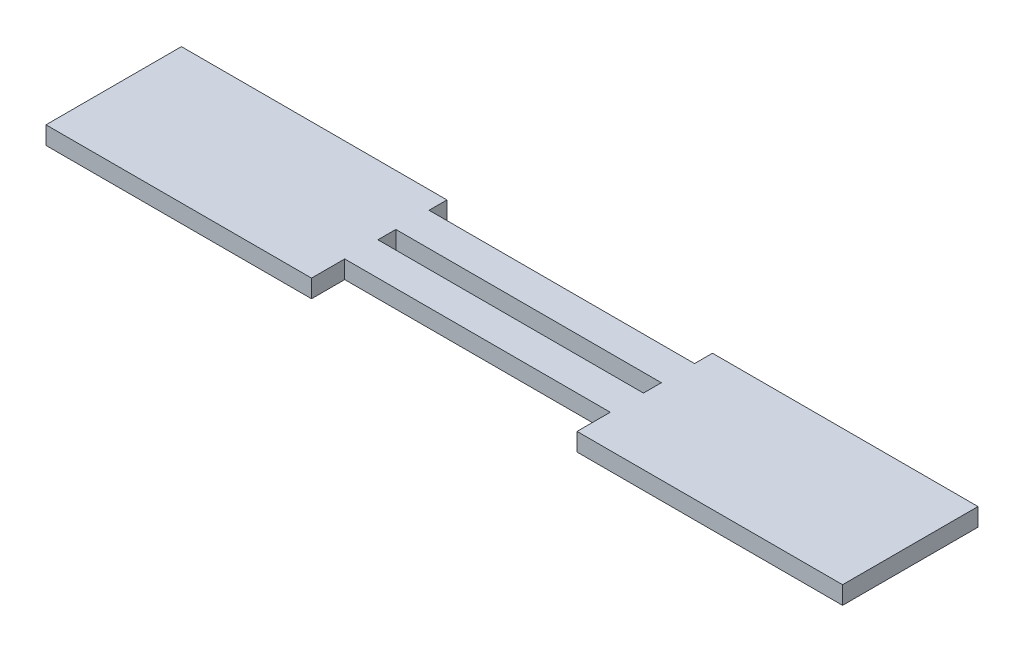
ISO-10303-21;
HEADER;
FILE_DESCRIPTION(('STEP AP214'),'2;1');
FILE_NAME('part.step','',(''),(''),'','','');
FILE_SCHEMA(('AUTOMOTIVE_DESIGN { 1 0 10303 214 1 1 1 1 }'));
ENDSEC;
DATA;
#1=APPLICATION_CONTEXT('core data for automotive mechanical design processes');
#2=APPLICATION_PROTOCOL_DEFINITION('international standard','automotive_design',2000,#1);
#3=PRODUCT_CONTEXT('',#1,'mechanical');
#4=PRODUCT('Part','Part','',(#3));
#5=PRODUCT_RELATED_PRODUCT_CATEGORY('part','',(#4));
#6=PRODUCT_DEFINITION_FORMATION('','',#4);
#7=PRODUCT_DEFINITION_CONTEXT('part definition',#1,'design');
#8=PRODUCT_DEFINITION('design','',#6,#7);
#9=PRODUCT_DEFINITION_SHAPE('','',#8);
#10=(LENGTH_UNIT() NAMED_UNIT(*) SI_UNIT(.MILLI.,.METRE.));
#11=(NAMED_UNIT(*) PLANE_ANGLE_UNIT() SI_UNIT($,.RADIAN.));
#12=(NAMED_UNIT(*) SI_UNIT($,.STERADIAN.) SOLID_ANGLE_UNIT());
#13=UNCERTAINTY_MEASURE_WITH_UNIT(LENGTH_MEASURE(1.E-05),#10,'distance_accuracy_value','');
#14=(GEOMETRIC_REPRESENTATION_CONTEXT(3) GLOBAL_UNCERTAINTY_ASSIGNED_CONTEXT((#13)) GLOBAL_UNIT_ASSIGNED_CONTEXT((#10,
#11,#12)) REPRESENTATION_CONTEXT('',''));
#15=CARTESIAN_POINT('',(0.,0.,0.));
#16=DIRECTION('',(0.,0.,1.));
#17=DIRECTION('',(1.,0.,0.));
#18=AXIS2_PLACEMENT_3D('',#15,#16,#17);
#19=CARTESIAN_POINT('',(0.,2.7,0.));
#20=DIRECTION('',(0.,-1.,0.));
#21=DIRECTION('',(0.,0.,-1.));
#22=AXIS2_PLACEMENT_3D('',#19,#20,#21);
#23=PLANE('',#22);
#24=DIRECTION('',(1.,0.,0.));
#25=VECTOR('',#24,1.);
#26=CARTESIAN_POINT('',(20.,2.7,15.9090628345809));
#27=LINE('',#26,#25);
#28=CARTESIAN_POINT('',(20.,2.7,15.9090628345809));
#29=VERTEX_POINT('',#28);
#30=CARTESIAN_POINT('',(60.,2.7,15.9090628345809));
#31=VERTEX_POINT('',#30);
#32=EDGE_CURVE('E182',#29,#31,#27,.T.);
#33=ORIENTED_EDGE('',*,*,#32,.T.);
#34=DIRECTION('',(0.,0.,-1.));
#35=VECTOR('',#34,1.);
#36=CARTESIAN_POINT('',(60.,2.7,5.90906283458089));
#37=LINE('',#36,#35);
#38=CARTESIAN_POINT('',(60.,2.7,-4.49093716541911));
#39=VERTEX_POINT('',#38);
#40=EDGE_CURVE('E185',#31,#39,#37,.T.);
#41=ORIENTED_EDGE('',*,*,#40,.T.);
#42=DIRECTION('',(-1.,0.,0.));
#43=VECTOR('',#42,1.);
#44=CARTESIAN_POINT('',(20.,2.7,-4.49093716541911));
#45=LINE('',#44,#43);
#46=CARTESIAN_POINT('',(20.,2.7,-4.49093716541911));
#47=VERTEX_POINT('',#46);
#48=EDGE_CURVE('E188',#39,#47,#45,.T.);
#49=ORIENTED_EDGE('',*,*,#48,.T.);
#50=DIRECTION('',(0.,0.,1.));
#51=VECTOR('',#50,1.);
#52=CARTESIAN_POINT('',(20.,2.7,-4.49093716541911));
#53=LINE('',#52,#51);
#54=CARTESIAN_POINT('',(20.,2.7,-1.79093716541911));
#55=VERTEX_POINT('',#54);
#56=EDGE_CURVE('E190',#47,#55,#53,.T.);
#57=ORIENTED_EDGE('',*,*,#56,.T.);
#58=DIRECTION('',(-1.,0.,0.));
#59=VECTOR('',#58,1.);
#60=CARTESIAN_POINT('',(-20.,2.7,-1.79093716541911));
#61=LINE('',#60,#59);
#62=CARTESIAN_POINT('',(-20.,2.7,-1.79093716541911));
#63=VERTEX_POINT('',#62);
#64=EDGE_CURVE('E192',#55,#63,#61,.T.);
#65=ORIENTED_EDGE('',*,*,#64,.T.);
#66=DIRECTION('',(0.,0.,-1.));
#67=VECTOR('',#66,1.);
#68=CARTESIAN_POINT('',(-20.,2.7,-4.49093716541911));
#69=LINE('',#68,#67);
#70=CARTESIAN_POINT('',(-20.,2.7,-4.49093716541911));
#71=VERTEX_POINT('',#70);
#72=EDGE_CURVE('E194',#63,#71,#69,.T.);
#73=ORIENTED_EDGE('',*,*,#72,.T.);
#74=DIRECTION('',(-1.,0.,0.));
#75=VECTOR('',#74,1.);
#76=CARTESIAN_POINT('',(-60.,2.7,-4.49093716541911));
#77=LINE('',#76,#75);
#78=CARTESIAN_POINT('',(-60.,2.7,-4.49093716541911));
#79=VERTEX_POINT('',#78);
#80=EDGE_CURVE('E196',#71,#79,#77,.T.);
#81=ORIENTED_EDGE('',*,*,#80,.T.);
#82=DIRECTION('',(0.,0.,1.));
#83=VECTOR('',#82,1.);
#84=CARTESIAN_POINT('',(-60.,2.7,-4.49093716541911));
#85=LINE('',#84,#83);
#86=CARTESIAN_POINT('',(-60.,2.7,15.9090628345809));
#87=VERTEX_POINT('',#86);
#88=EDGE_CURVE('E198',#79,#87,#85,.T.);
#89=ORIENTED_EDGE('',*,*,#88,.T.);
#90=DIRECTION('',(1.,0.,0.));
#91=VECTOR('',#90,1.);
#92=CARTESIAN_POINT('',(-60.,2.7,15.9090628345809));
#93=LINE('',#92,#91);
#94=CARTESIAN_POINT('',(-20.,2.7,15.9090628345809));
#95=VERTEX_POINT('',#94);
#96=EDGE_CURVE('E200',#87,#95,#93,.T.);
#97=ORIENTED_EDGE('',*,*,#96,.T.);
#98=DIRECTION('',(0.,0.,-1.));
#99=VECTOR('',#98,1.);
#100=CARTESIAN_POINT('',(-20.,2.7,10.9090628345809));
#101=LINE('',#100,#99);
#102=CARTESIAN_POINT('',(-20.,2.7,10.9090628345809));
#103=VERTEX_POINT('',#102);
#104=EDGE_CURVE('E202',#95,#103,#101,.T.);
#105=ORIENTED_EDGE('',*,*,#104,.T.);
#106=DIRECTION('',(1.,0.,0.));
#107=VECTOR('',#106,1.);
#108=CARTESIAN_POINT('',(-20.,2.7,10.9090628345809));
#109=LINE('',#108,#107);
#110=CARTESIAN_POINT('',(20.,2.7,10.9090628345809));
#111=VERTEX_POINT('',#110);
#112=EDGE_CURVE('E204',#103,#111,#109,.T.);
#113=ORIENTED_EDGE('',*,*,#112,.T.);
#114=DIRECTION('',(0.,0.,1.));
#115=VECTOR('',#114,1.);
#116=CARTESIAN_POINT('',(20.,2.7,10.9090628345809));
#117=LINE('',#116,#115);
#118=EDGE_CURVE('E206',#111,#29,#117,.T.);
#119=ORIENTED_EDGE('',*,*,#118,.T.);
#120=EDGE_LOOP('',(#33,#41,#49,#57,#65,#73,#81,#89,#97,#105,#113,#119));
#121=FACE_BOUND('',#120,.T.);
#122=DIRECTION('',(0.,0.,1.));
#123=VECTOR('',#122,1.);
#124=CARTESIAN_POINT('',(-20.,2.7,3.20906283458089));
#125=LINE('',#124,#123);
#126=CARTESIAN_POINT('',(-20.,2.7,3.20906283458089));
#127=VERTEX_POINT('',#126);
#128=CARTESIAN_POINT('',(-20.,2.7,5.90906283458089));
#129=VERTEX_POINT('',#128);
#130=EDGE_CURVE('E146',#127,#129,#125,.T.);
#131=ORIENTED_EDGE('',*,*,#130,.F.);
#132=DIRECTION('',(-1.,0.,0.));
#133=VECTOR('',#132,1.);
#134=CARTESIAN_POINT('',(-20.,2.7,3.20906283458089));
#135=LINE('',#134,#133);
#136=CARTESIAN_POINT('',(20.,2.7,3.20906283458089));
#137=VERTEX_POINT('',#136);
#138=EDGE_CURVE('E168',#137,#127,#135,.T.);
#139=ORIENTED_EDGE('',*,*,#138,.F.);
#140=DIRECTION('',(0.,0.,-1.));
#141=VECTOR('',#140,1.);
#142=CARTESIAN_POINT('',(20.,2.7,3.20906283458089));
#143=LINE('',#142,#141);
#144=CARTESIAN_POINT('',(20.,2.7,5.90906283458089));
#145=VERTEX_POINT('',#144);
#146=EDGE_CURVE('E166',#145,#137,#143,.T.);
#147=ORIENTED_EDGE('',*,*,#146,.F.);
#148=DIRECTION('',(1.,0.,0.));
#149=VECTOR('',#148,1.);
#150=CARTESIAN_POINT('',(20.,2.7,5.90906283458089));
#151=LINE('',#150,#149);
#152=EDGE_CURVE('E154',#129,#145,#151,.T.);
#153=ORIENTED_EDGE('',*,*,#152,.F.);
#154=EDGE_LOOP('',(#131,#139,#147,#153));
#155=FACE_BOUND('',#154,.T.);
#156=ADVANCED_FACE('F33',(#121,#155),#23,.F.);
#157=CARTESIAN_POINT('',(0.,0.,0.));
#158=DIRECTION('',(0.,-1.,0.));
#159=DIRECTION('',(0.,0.,-1.));
#160=AXIS2_PLACEMENT_3D('',#157,#158,#159);
#161=PLANE('',#160);
#162=DIRECTION('',(1.,0.,0.));
#163=VECTOR('',#162,1.);
#164=CARTESIAN_POINT('',(20.,0.,15.9090628345809));
#165=LINE('',#164,#163);
#166=CARTESIAN_POINT('',(20.,0.,15.9090628345809));
#167=VERTEX_POINT('',#166);
#168=CARTESIAN_POINT('',(60.,0.,15.9090628345809));
#169=VERTEX_POINT('',#168);
#170=EDGE_CURVE('E162',#167,#169,#165,.T.);
#171=ORIENTED_EDGE('',*,*,#170,.F.);
#172=DIRECTION('',(0.,0.,1.));
#173=VECTOR('',#172,1.);
#174=CARTESIAN_POINT('',(20.,0.,10.9090628345809));
#175=LINE('',#174,#173);
#176=CARTESIAN_POINT('',(20.,0.,10.9090628345809));
#177=VERTEX_POINT('',#176);
#178=EDGE_CURVE('E186',#177,#167,#175,.T.);
#179=ORIENTED_EDGE('',*,*,#178,.F.);
#180=DIRECTION('',(1.,0.,0.));
#181=VECTOR('',#180,1.);
#182=CARTESIAN_POINT('',(-20.,0.,10.9090628345809));
#183=LINE('',#182,#181);
#184=CARTESIAN_POINT('',(-20.,0.,10.9090628345809));
#185=VERTEX_POINT('',#184);
#186=EDGE_CURVE('E230',#185,#177,#183,.T.);
#187=ORIENTED_EDGE('',*,*,#186,.F.);
#188=DIRECTION('',(0.,0.,-1.));
#189=VECTOR('',#188,1.);
#190=CARTESIAN_POINT('',(-20.,0.,10.9090628345809));
#191=LINE('',#190,#189);
#192=CARTESIAN_POINT('',(-20.,0.,15.9090628345809));
#193=VERTEX_POINT('',#192);
#194=EDGE_CURVE('E228',#193,#185,#191,.T.);
#195=ORIENTED_EDGE('',*,*,#194,.F.);
#196=DIRECTION('',(1.,0.,0.));
#197=VECTOR('',#196,1.);
#198=CARTESIAN_POINT('',(-60.,0.,15.9090628345809));
#199=LINE('',#198,#197);
#200=CARTESIAN_POINT('',(-60.,0.,15.9090628345809));
#201=VERTEX_POINT('',#200);
#202=EDGE_CURVE('E226',#201,#193,#199,.T.);
#203=ORIENTED_EDGE('',*,*,#202,.F.);
#204=DIRECTION('',(0.,0.,1.));
#205=VECTOR('',#204,1.);
#206=CARTESIAN_POINT('',(-60.,0.,5.90906283458089));
#207=LINE('',#206,#205);
#208=CARTESIAN_POINT('',(-60.,0.,-4.49093716541911));
#209=VERTEX_POINT('',#208);
#210=EDGE_CURVE('E224',#209,#201,#207,.T.);
#211=ORIENTED_EDGE('',*,*,#210,.F.);
#212=DIRECTION('',(-1.,0.,0.));
#213=VECTOR('',#212,1.);
#214=CARTESIAN_POINT('',(-60.,0.,-4.49093716541911));
#215=LINE('',#214,#213);
#216=CARTESIAN_POINT('',(-20.,0.,-4.49093716541911));
#217=VERTEX_POINT('',#216);
#218=EDGE_CURVE('E221',#217,#209,#215,.T.);
#219=ORIENTED_EDGE('',*,*,#218,.F.);
#220=DIRECTION('',(0.,0.,-1.));
#221=VECTOR('',#220,1.);
#222=CARTESIAN_POINT('',(-20.,0.,-4.49093716541911));
#223=LINE('',#222,#221);
#224=CARTESIAN_POINT('',(-20.,0.,-1.79093716541911));
#225=VERTEX_POINT('',#224);
#226=EDGE_CURVE('E219',#225,#217,#223,.T.);
#227=ORIENTED_EDGE('',*,*,#226,.F.);
#228=DIRECTION('',(-1.,0.,0.));
#229=VECTOR('',#228,1.);
#230=CARTESIAN_POINT('',(-20.,0.,-1.79093716541911));
#231=LINE('',#230,#229);
#232=CARTESIAN_POINT('',(20.,0.,-1.79093716541911));
#233=VERTEX_POINT('',#232);
#234=EDGE_CURVE('E217',#233,#225,#231,.T.);
#235=ORIENTED_EDGE('',*,*,#234,.F.);
#236=DIRECTION('',(0.,0.,1.));
#237=VECTOR('',#236,1.);
#238=CARTESIAN_POINT('',(20.,0.,-4.49093716541911));
#239=LINE('',#238,#237);
#240=CARTESIAN_POINT('',(20.,0.,-4.49093716541911));
#241=VERTEX_POINT('',#240);
#242=EDGE_CURVE('E215',#241,#233,#239,.T.);
#243=ORIENTED_EDGE('',*,*,#242,.F.);
#244=DIRECTION('',(-1.,0.,0.));
#245=VECTOR('',#244,1.);
#246=CARTESIAN_POINT('',(20.,0.,-4.49093716541911));
#247=LINE('',#246,#245);
#248=CARTESIAN_POINT('',(60.,0.,-4.49093716541911));
#249=VERTEX_POINT('',#248);
#250=EDGE_CURVE('E213',#249,#241,#247,.T.);
#251=ORIENTED_EDGE('',*,*,#250,.F.);
#252=DIRECTION('',(0.,0.,-1.));
#253=VECTOR('',#252,1.);
#254=CARTESIAN_POINT('',(60.,0.,-4.49093716541911));
#255=LINE('',#254,#253);
#256=EDGE_CURVE('E211',#169,#249,#255,.T.);
#257=ORIENTED_EDGE('',*,*,#256,.F.);
#258=EDGE_LOOP('',(#171,#179,#187,#195,#203,#211,#219,#227,#235,#243,#251,#257));
#259=FACE_BOUND('',#258,.T.);
#260=DIRECTION('',(-1.,0.,0.));
#261=VECTOR('',#260,1.);
#262=CARTESIAN_POINT('',(-20.,0.,3.20906283458089));
#263=LINE('',#262,#261);
#264=CARTESIAN_POINT('',(20.,0.,3.20906283458089));
#265=VERTEX_POINT('',#264);
#266=CARTESIAN_POINT('',(-20.,0.,3.20906283458089));
#267=VERTEX_POINT('',#266);
#268=EDGE_CURVE('E155',#265,#267,#263,.T.);
#269=ORIENTED_EDGE('',*,*,#268,.T.);
#270=DIRECTION('',(0.,0.,1.));
#271=VECTOR('',#270,1.);
#272=CARTESIAN_POINT('',(-20.,0.,3.20906283458089));
#273=LINE('',#272,#271);
#274=CARTESIAN_POINT('',(-20.,0.,5.90906283458089));
#275=VERTEX_POINT('',#274);
#276=EDGE_CURVE('E56',#267,#275,#273,.T.);
#277=ORIENTED_EDGE('',*,*,#276,.T.);
#278=DIRECTION('',(1.,0.,0.));
#279=VECTOR('',#278,1.);
#280=CARTESIAN_POINT('',(20.,0.,5.90906283458089));
#281=LINE('',#280,#279);
#282=CARTESIAN_POINT('',(20.,0.,5.90906283458089));
#283=VERTEX_POINT('',#282);
#284=EDGE_CURVE('E161',#275,#283,#281,.T.);
#285=ORIENTED_EDGE('',*,*,#284,.T.);
#286=DIRECTION('',(0.,0.,-1.));
#287=VECTOR('',#286,1.);
#288=CARTESIAN_POINT('',(20.,0.,3.20906283458089));
#289=LINE('',#288,#287);
#290=EDGE_CURVE('E174',#283,#265,#289,.T.);
#291=ORIENTED_EDGE('',*,*,#290,.T.);
#292=EDGE_LOOP('',(#269,#277,#285,#291));
#293=FACE_BOUND('',#292,.T.);
#294=ADVANCED_FACE('F272',(#259,#293),#161,.T.);
#295=CARTESIAN_POINT('',(20.,2.7,15.9090628345809));
#296=DIRECTION('',(0.,0.,-1.));
#297=DIRECTION('',(-1.,0.,0.));
#298=AXIS2_PLACEMENT_3D('',#295,#296,#297);
#299=PLANE('',#298);
#300=ORIENTED_EDGE('',*,*,#170,.T.);
#301=DIRECTION('',(0.,-1.,0.));
#302=VECTOR('',#301,1.);
#303=CARTESIAN_POINT('',(60.,2.7,15.9090628345809));
#304=LINE('',#303,#302);
#305=EDGE_CURVE('E11',#31,#169,#304,.T.);
#306=ORIENTED_EDGE('',*,*,#305,.F.);
#307=ORIENTED_EDGE('',*,*,#32,.F.);
#308=DIRECTION('',(0.,-1.,0.));
#309=VECTOR('',#308,1.);
#310=CARTESIAN_POINT('',(20.,2.7,15.9090628345809));
#311=LINE('',#310,#309);
#312=EDGE_CURVE('E208',#29,#167,#311,.T.);
#313=ORIENTED_EDGE('',*,*,#312,.T.);
#314=EDGE_LOOP('',(#300,#306,#307,#313));
#315=FACE_BOUND('',#314,.T.);
#316=ADVANCED_FACE('F35',(#315),#299,.F.);
#317=CARTESIAN_POINT('',(60.,2.7,-4.49093716541911));
#318=DIRECTION('',(-1.,0.,0.));
#319=DIRECTION('',(0.,0.,1.));
#320=AXIS2_PLACEMENT_3D('',#317,#318,#319);
#321=PLANE('',#320);
#322=ORIENTED_EDGE('',*,*,#256,.T.);
#323=DIRECTION('',(0.,-1.,0.));
#324=VECTOR('',#323,1.);
#325=CARTESIAN_POINT('',(60.,2.7,-4.49093716541911));
#326=LINE('',#325,#324);
#327=EDGE_CURVE('E41',#39,#249,#326,.T.);
#328=ORIENTED_EDGE('',*,*,#327,.F.);
#329=ORIENTED_EDGE('',*,*,#40,.F.);
#330=ORIENTED_EDGE('',*,*,#305,.T.);
#331=EDGE_LOOP('',(#322,#328,#329,#330));
#332=FACE_BOUND('',#331,.T.);
#333=ADVANCED_FACE('F289',(#332),#321,.F.);
#334=CARTESIAN_POINT('',(20.,2.7,-4.49093716541911));
#335=DIRECTION('',(0.,0.,1.));
#336=DIRECTION('',(1.,0.,0.));
#337=AXIS2_PLACEMENT_3D('',#334,#335,#336);
#338=PLANE('',#337);
#339=ORIENTED_EDGE('',*,*,#250,.T.);
#340=DIRECTION('',(0.,-1.,0.));
#341=VECTOR('',#340,1.);
#342=CARTESIAN_POINT('',(20.,2.7,-4.49093716541911));
#343=LINE('',#342,#341);
#344=EDGE_CURVE('E259',#47,#241,#343,.T.);
#345=ORIENTED_EDGE('',*,*,#344,.F.);
#346=ORIENTED_EDGE('',*,*,#48,.F.);
#347=ORIENTED_EDGE('',*,*,#327,.T.);
#348=EDGE_LOOP('',(#339,#345,#346,#347));
#349=FACE_BOUND('',#348,.T.);
#350=ADVANCED_FACE('F266',(#349),#338,.F.);
#351=CARTESIAN_POINT('',(20.,2.7,-4.49093716541911));
#352=DIRECTION('',(1.,0.,0.));
#353=DIRECTION('',(0.,0.,-1.));
#354=AXIS2_PLACEMENT_3D('',#351,#352,#353);
#355=PLANE('',#354);
#356=ORIENTED_EDGE('',*,*,#242,.T.);
#357=DIRECTION('',(0.,-1.,0.));
#358=VECTOR('',#357,1.);
#359=CARTESIAN_POINT('',(20.,2.7,-1.79093716541911));
#360=LINE('',#359,#358);
#361=EDGE_CURVE('E256',#55,#233,#360,.T.);
#362=ORIENTED_EDGE('',*,*,#361,.F.);
#363=ORIENTED_EDGE('',*,*,#56,.F.);
#364=ORIENTED_EDGE('',*,*,#344,.T.);
#365=EDGE_LOOP('',(#356,#362,#363,#364));
#366=FACE_BOUND('',#365,.T.);
#367=ADVANCED_FACE('F278',(#366),#355,.F.);
#368=CARTESIAN_POINT('',(-20.,2.7,-1.79093716541911));
#369=DIRECTION('',(0.,0.,1.));
#370=DIRECTION('',(1.,0.,0.));
#371=AXIS2_PLACEMENT_3D('',#368,#369,#370);
#372=PLANE('',#371);
#373=ORIENTED_EDGE('',*,*,#234,.T.);
#374=DIRECTION('',(0.,-1.,0.));
#375=VECTOR('',#374,1.);
#376=CARTESIAN_POINT('',(-20.,2.7,-1.79093716541911));
#377=LINE('',#376,#375);
#378=EDGE_CURVE('E253',#63,#225,#377,.T.);
#379=ORIENTED_EDGE('',*,*,#378,.F.);
#380=ORIENTED_EDGE('',*,*,#64,.F.);
#381=ORIENTED_EDGE('',*,*,#361,.T.);
#382=EDGE_LOOP('',(#373,#379,#380,#381));
#383=FACE_BOUND('',#382,.T.);
#384=ADVANCED_FACE('F282',(#383),#372,.F.);
#385=CARTESIAN_POINT('',(-20.,2.7,-4.49093716541911));
#386=DIRECTION('',(-1.,0.,0.));
#387=DIRECTION('',(0.,0.,1.));
#388=AXIS2_PLACEMENT_3D('',#385,#386,#387);
#389=PLANE('',#388);
#390=ORIENTED_EDGE('',*,*,#226,.T.);
#391=DIRECTION('',(0.,-1.,0.));
#392=VECTOR('',#391,1.);
#393=CARTESIAN_POINT('',(-20.,2.7,-4.49093716541911));
#394=LINE('',#393,#392);
#395=EDGE_CURVE('E250',#71,#217,#394,.T.);
#396=ORIENTED_EDGE('',*,*,#395,.F.);
#397=ORIENTED_EDGE('',*,*,#72,.F.);
#398=ORIENTED_EDGE('',*,*,#378,.T.);
#399=EDGE_LOOP('',(#390,#396,#397,#398));
#400=FACE_BOUND('',#399,.T.);
#401=ADVANCED_FACE('F321',(#400),#389,.F.);
#402=CARTESIAN_POINT('',(-60.,2.7,-4.49093716541911));
#403=DIRECTION('',(0.,0.,1.));
#404=DIRECTION('',(1.,0.,0.));
#405=AXIS2_PLACEMENT_3D('',#402,#403,#404);
#406=PLANE('',#405);
#407=ORIENTED_EDGE('',*,*,#218,.T.);
#408=DIRECTION('',(0.,-1.,0.));
#409=VECTOR('',#408,1.);
#410=CARTESIAN_POINT('',(-60.,2.7,-4.49093716541911));
#411=LINE('',#410,#409);
#412=EDGE_CURVE('E247',#79,#209,#411,.T.);
#413=ORIENTED_EDGE('',*,*,#412,.F.);
#414=ORIENTED_EDGE('',*,*,#80,.F.);
#415=ORIENTED_EDGE('',*,*,#395,.T.);
#416=EDGE_LOOP('',(#407,#413,#414,#415));
#417=FACE_BOUND('',#416,.T.);
#418=ADVANCED_FACE('F319',(#417),#406,.F.);
#419=CARTESIAN_POINT('',(-60.,2.7,5.90906283458089));
#420=DIRECTION('',(1.,0.,0.));
#421=DIRECTION('',(0.,0.,-1.));
#422=AXIS2_PLACEMENT_3D('',#419,#420,#421);
#423=PLANE('',#422);
#424=ORIENTED_EDGE('',*,*,#210,.T.);
#425=DIRECTION('',(0.,-1.,0.));
#426=VECTOR('',#425,1.);
#427=CARTESIAN_POINT('',(-60.,2.7,15.9090628345809));
#428=LINE('',#427,#426);
#429=EDGE_CURVE('E244',#87,#201,#428,.T.);
#430=ORIENTED_EDGE('',*,*,#429,.F.);
#431=ORIENTED_EDGE('',*,*,#88,.F.);
#432=ORIENTED_EDGE('',*,*,#412,.T.);
#433=EDGE_LOOP('',(#424,#430,#431,#432));
#434=FACE_BOUND('',#433,.T.);
#435=ADVANCED_FACE('F315',(#434),#423,.F.);
#436=CARTESIAN_POINT('',(-60.,2.7,15.9090628345809));
#437=DIRECTION('',(0.,0.,-1.));
#438=DIRECTION('',(-1.,0.,0.));
#439=AXIS2_PLACEMENT_3D('',#436,#437,#438);
#440=PLANE('',#439);
#441=ORIENTED_EDGE('',*,*,#202,.T.);
#442=DIRECTION('',(0.,-1.,0.));
#443=VECTOR('',#442,1.);
#444=CARTESIAN_POINT('',(-20.,2.7,15.9090628345809));
#445=LINE('',#444,#443);
#446=EDGE_CURVE('E241',#95,#193,#445,.T.);
#447=ORIENTED_EDGE('',*,*,#446,.F.);
#448=ORIENTED_EDGE('',*,*,#96,.F.);
#449=ORIENTED_EDGE('',*,*,#429,.T.);
#450=EDGE_LOOP('',(#441,#447,#448,#449));
#451=FACE_BOUND('',#450,.T.);
#452=ADVANCED_FACE('F310',(#451),#440,.F.);
#453=CARTESIAN_POINT('',(-20.,2.7,10.9090628345809));
#454=DIRECTION('',(-1.,0.,0.));
#455=DIRECTION('',(0.,0.,1.));
#456=AXIS2_PLACEMENT_3D('',#453,#454,#455);
#457=PLANE('',#456);
#458=ORIENTED_EDGE('',*,*,#194,.T.);
#459=DIRECTION('',(0.,-1.,0.));
#460=VECTOR('',#459,1.);
#461=CARTESIAN_POINT('',(-20.,2.7,10.9090628345809));
#462=LINE('',#461,#460);
#463=EDGE_CURVE('E238',#103,#185,#462,.T.);
#464=ORIENTED_EDGE('',*,*,#463,.F.);
#465=ORIENTED_EDGE('',*,*,#104,.F.);
#466=ORIENTED_EDGE('',*,*,#446,.T.);
#467=EDGE_LOOP('',(#458,#464,#465,#466));
#468=FACE_BOUND('',#467,.T.);
#469=ADVANCED_FACE('F305',(#468),#457,.F.);
#470=CARTESIAN_POINT('',(-20.,2.7,10.9090628345809));
#471=DIRECTION('',(0.,0.,-1.));
#472=DIRECTION('',(-1.,0.,0.));
#473=AXIS2_PLACEMENT_3D('',#470,#471,#472);
#474=PLANE('',#473);
#475=ORIENTED_EDGE('',*,*,#186,.T.);
#476=DIRECTION('',(0.,-1.,0.));
#477=VECTOR('',#476,1.);
#478=CARTESIAN_POINT('',(20.,2.7,10.9090628345809));
#479=LINE('',#478,#477);
#480=EDGE_CURVE('E235',#111,#177,#479,.T.);
#481=ORIENTED_EDGE('',*,*,#480,.F.);
#482=ORIENTED_EDGE('',*,*,#112,.F.);
#483=ORIENTED_EDGE('',*,*,#463,.T.);
#484=EDGE_LOOP('',(#475,#481,#482,#483));
#485=FACE_BOUND('',#484,.T.);
#486=ADVANCED_FACE('F301',(#485),#474,.F.);
#487=CARTESIAN_POINT('',(20.,2.7,10.9090628345809));
#488=DIRECTION('',(1.,0.,0.));
#489=DIRECTION('',(0.,0.,-1.));
#490=AXIS2_PLACEMENT_3D('',#487,#488,#489);
#491=PLANE('',#490);
#492=ORIENTED_EDGE('',*,*,#178,.T.);
#493=ORIENTED_EDGE('',*,*,#312,.F.);
#494=ORIENTED_EDGE('',*,*,#118,.F.);
#495=ORIENTED_EDGE('',*,*,#480,.T.);
#496=EDGE_LOOP('',(#492,#493,#494,#495));
#497=FACE_BOUND('',#496,.T.);
#498=ADVANCED_FACE('F296',(#497),#491,.F.);
#499=CARTESIAN_POINT('',(-20.,2.7,3.20906283458089));
#500=DIRECTION('',(1.,0.,0.));
#501=DIRECTION('',(0.,0.,-1.));
#502=AXIS2_PLACEMENT_3D('',#499,#500,#501);
#503=PLANE('',#502);
#504=ORIENTED_EDGE('',*,*,#276,.F.);
#505=DIRECTION('',(0.,-1.,0.));
#506=VECTOR('',#505,1.);
#507=CARTESIAN_POINT('',(-20.,2.7,3.20906283458089));
#508=LINE('',#507,#506);
#509=EDGE_CURVE('E150',#127,#267,#508,.T.);
#510=ORIENTED_EDGE('',*,*,#509,.F.);
#511=ORIENTED_EDGE('',*,*,#130,.T.);
#512=DIRECTION('',(0.,-1.,0.));
#513=VECTOR('',#512,1.);
#514=CARTESIAN_POINT('',(-20.,2.7,5.90906283458089));
#515=LINE('',#514,#513);
#516=EDGE_CURVE('E149',#129,#275,#515,.T.);
#517=ORIENTED_EDGE('',*,*,#516,.T.);
#518=EDGE_LOOP('',(#504,#510,#511,#517));
#519=FACE_BOUND('',#518,.T.);
#520=ADVANCED_FACE('F148',(#519),#503,.T.);
#521=CARTESIAN_POINT('',(20.,2.7,5.90906283458089));
#522=DIRECTION('',(0.,0.,-1.));
#523=DIRECTION('',(-1.,0.,0.));
#524=AXIS2_PLACEMENT_3D('',#521,#522,#523);
#525=PLANE('',#524);
#526=ORIENTED_EDGE('',*,*,#284,.F.);
#527=ORIENTED_EDGE('',*,*,#516,.F.);
#528=ORIENTED_EDGE('',*,*,#152,.T.);
#529=DIRECTION('',(0.,-1.,0.));
#530=VECTOR('',#529,1.);
#531=CARTESIAN_POINT('',(20.,2.7,5.90906283458089));
#532=LINE('',#531,#530);
#533=EDGE_CURVE('E163',#145,#283,#532,.T.);
#534=ORIENTED_EDGE('',*,*,#533,.T.);
#535=EDGE_LOOP('',(#526,#527,#528,#534));
#536=FACE_BOUND('',#535,.T.);
#537=ADVANCED_FACE('F158',(#536),#525,.T.);
#538=CARTESIAN_POINT('',(20.,2.7,3.20906283458089));
#539=DIRECTION('',(-1.,0.,0.));
#540=DIRECTION('',(0.,0.,1.));
#541=AXIS2_PLACEMENT_3D('',#538,#539,#540);
#542=PLANE('',#541);
#543=ORIENTED_EDGE('',*,*,#290,.F.);
#544=ORIENTED_EDGE('',*,*,#533,.F.);
#545=ORIENTED_EDGE('',*,*,#146,.T.);
#546=DIRECTION('',(0.,-1.,0.));
#547=VECTOR('',#546,1.);
#548=CARTESIAN_POINT('',(20.,2.7,3.20906283458089));
#549=LINE('',#548,#547);
#550=EDGE_CURVE('E48',#137,#265,#549,.T.);
#551=ORIENTED_EDGE('',*,*,#550,.T.);
#552=EDGE_LOOP('',(#543,#544,#545,#551));
#553=FACE_BOUND('',#552,.T.);
#554=ADVANCED_FACE('F379',(#553),#542,.T.);
#555=CARTESIAN_POINT('',(-20.,2.7,3.20906283458089));
#556=DIRECTION('',(0.,0.,1.));
#557=DIRECTION('',(1.,0.,0.));
#558=AXIS2_PLACEMENT_3D('',#555,#556,#557);
#559=PLANE('',#558);
#560=ORIENTED_EDGE('',*,*,#268,.F.);
#561=ORIENTED_EDGE('',*,*,#550,.F.);
#562=ORIENTED_EDGE('',*,*,#138,.T.);
#563=ORIENTED_EDGE('',*,*,#509,.T.);
#564=EDGE_LOOP('',(#560,#561,#562,#563));
#565=FACE_BOUND('',#564,.T.);
#566=ADVANCED_FACE('F385',(#565),#559,.T.);
#567=CLOSED_SHELL('',(#156,#294,#316,#333,#350,#367,#384,#401,#418,#435,#452,#469,#486,#498,
#520,#537,#554,#566));
#568=MANIFOLD_SOLID_BREP('B2',#567);
#569=ADVANCED_BREP_SHAPE_REPRESENTATION('',(#18,#568),#14);
#570=SHAPE_DEFINITION_REPRESENTATION(#9,#569);
ENDSEC;
END-ISO-10303-21;
